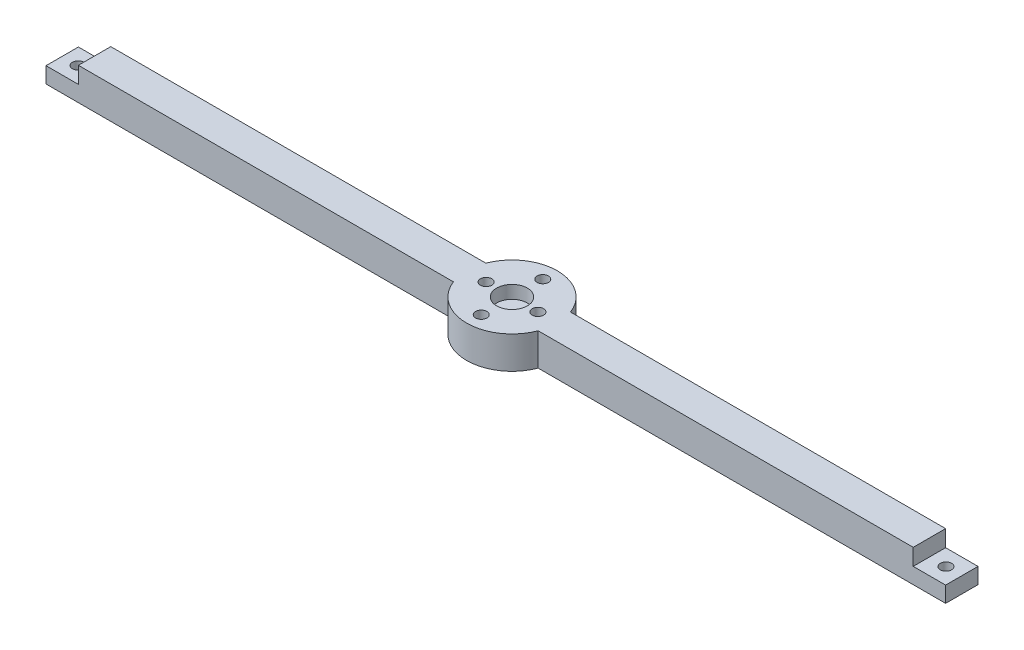
ISO-10303-21;
HEADER;
FILE_DESCRIPTION(('STEP AP214'),'2;1');
FILE_NAME('part.step','',(''),(''),'','','');
FILE_SCHEMA(('AUTOMOTIVE_DESIGN { 1 0 10303 214 1 1 1 1 }'));
ENDSEC;
DATA;
#1=APPLICATION_CONTEXT('core data for automotive mechanical design processes');
#2=APPLICATION_PROTOCOL_DEFINITION('international standard','automotive_design',2000,#1);
#3=PRODUCT_CONTEXT('',#1,'mechanical');
#4=PRODUCT('Part','Part','',(#3));
#5=PRODUCT_RELATED_PRODUCT_CATEGORY('part','',(#4));
#6=PRODUCT_DEFINITION_FORMATION('','',#4);
#7=PRODUCT_DEFINITION_CONTEXT('part definition',#1,'design');
#8=PRODUCT_DEFINITION('design','',#6,#7);
#9=PRODUCT_DEFINITION_SHAPE('','',#8);
#10=(LENGTH_UNIT() NAMED_UNIT(*) SI_UNIT(.MILLI.,.METRE.));
#11=(NAMED_UNIT(*) PLANE_ANGLE_UNIT() SI_UNIT($,.RADIAN.));
#12=(NAMED_UNIT(*) SI_UNIT($,.STERADIAN.) SOLID_ANGLE_UNIT());
#13=UNCERTAINTY_MEASURE_WITH_UNIT(LENGTH_MEASURE(1.E-05),#10,'distance_accuracy_value','');
#14=(GEOMETRIC_REPRESENTATION_CONTEXT(3) GLOBAL_UNCERTAINTY_ASSIGNED_CONTEXT((#13)) GLOBAL_UNIT_ASSIGNED_CONTEXT((#10,
#11,#12)) REPRESENTATION_CONTEXT('',''));
#15=CARTESIAN_POINT('',(0.,0.,0.));
#16=DIRECTION('',(0.,0.,1.));
#17=DIRECTION('',(1.,0.,0.));
#18=AXIS2_PLACEMENT_3D('',#15,#16,#17);
#19=CARTESIAN_POINT('',(0.,10.,0.));
#20=DIRECTION('',(0.,-1.,0.));
#21=DIRECTION('',(0.,0.,-1.));
#22=AXIS2_PLACEMENT_3D('',#19,#20,#21);
#23=CYLINDRICAL_SURFACE('',#22,14.);
#24=CARTESIAN_POINT('',(0.,0.,0.));
#25=DIRECTION('',(0.,1.,0.));
#26=DIRECTION('',(0.,0.,1.));
#27=AXIS2_PLACEMENT_3D('',#24,#25,#26);
#28=CIRCLE('',#27,14.);
#29=CARTESIAN_POINT('',(13.076696830622,0.,-5.));
#30=VERTEX_POINT('',#29);
#31=CARTESIAN_POINT('',(-13.076696830622,0.,-5.));
#32=VERTEX_POINT('',#31);
#33=EDGE_CURVE('E230',#30,#32,#28,.T.);
#34=ORIENTED_EDGE('',*,*,#33,.T.);
#35=DIRECTION('',(0.,1.,0.));
#36=VECTOR('',#35,1.);
#37=CARTESIAN_POINT('',(-13.076696830622,-136.29066125188,-5.));
#38=LINE('',#37,#36);
#39=CARTESIAN_POINT('',(-13.076696830622,10.,-5.));
#40=VERTEX_POINT('',#39);
#41=EDGE_CURVE('E157',#32,#40,#38,.T.);
#42=ORIENTED_EDGE('',*,*,#41,.T.);
#43=CARTESIAN_POINT('',(0.,10.,0.));
#44=DIRECTION('',(0.,1.,0.));
#45=DIRECTION('',(0.,0.,1.));
#46=AXIS2_PLACEMENT_3D('',#43,#44,#45);
#47=CIRCLE('',#46,14.);
#48=CARTESIAN_POINT('',(13.076696830622,10.,-5.));
#49=VERTEX_POINT('',#48);
#50=EDGE_CURVE('E150',#49,#40,#47,.T.);
#51=ORIENTED_EDGE('',*,*,#50,.F.);
#52=DIRECTION('',(0.,1.,0.));
#53=VECTOR('',#52,1.);
#54=CARTESIAN_POINT('',(13.076696830622,-136.29066125188,-5.));
#55=LINE('',#54,#53);
#56=EDGE_CURVE('E215',#30,#49,#55,.T.);
#57=ORIENTED_EDGE('',*,*,#56,.F.);
#58=EDGE_LOOP('',(#34,#42,#51,#57));
#59=FACE_BOUND('',#58,.T.);
#60=ADVANCED_FACE('F38',(#59),#23,.T.);
#61=CARTESIAN_POINT('',(-13.076696830622,10.,5.));
#62=VERTEX_POINT('',#61);
#63=CARTESIAN_POINT('',(13.076696830622,10.,5.));
#64=VERTEX_POINT('',#63);
#65=EDGE_CURVE('E229',#62,#64,#47,.T.);
#66=ORIENTED_EDGE('',*,*,#65,.F.);
#67=DIRECTION('',(0.,1.,0.));
#68=VECTOR('',#67,1.);
#69=CARTESIAN_POINT('',(-13.076696830622,-136.29066125188,5.));
#70=LINE('',#69,#68);
#71=CARTESIAN_POINT('',(-13.076696830622,0.,5.));
#72=VERTEX_POINT('',#71);
#73=EDGE_CURVE('E152',#72,#62,#70,.T.);
#74=ORIENTED_EDGE('',*,*,#73,.F.);
#75=CARTESIAN_POINT('',(13.076696830622,0.,5.));
#76=VERTEX_POINT('',#75);
#77=EDGE_CURVE('E225',#72,#76,#28,.T.);
#78=ORIENTED_EDGE('',*,*,#77,.T.);
#79=DIRECTION('',(0.,1.,0.));
#80=VECTOR('',#79,1.);
#81=CARTESIAN_POINT('',(13.076696830622,-136.29066125188,5.));
#82=LINE('',#81,#80);
#83=EDGE_CURVE('E208',#76,#64,#82,.T.);
#84=ORIENTED_EDGE('',*,*,#83,.T.);
#85=EDGE_LOOP('',(#66,#74,#78,#84));
#86=FACE_BOUND('',#85,.T.);
#87=ADVANCED_FACE('F40',(#86),#23,.T.);
#88=CARTESIAN_POINT('',(0.,10.,0.));
#89=DIRECTION('',(0.,1.,0.));
#90=DIRECTION('',(0.,0.,1.));
#91=AXIS2_PLACEMENT_3D('',#88,#89,#90);
#92=PLANE('',#91);
#93=CARTESIAN_POINT('',(0.,10.,0.));
#94=DIRECTION('',(0.,1.,0.));
#95=DIRECTION('',(0.,0.,1.));
#96=AXIS2_PLACEMENT_3D('',#93,#94,#95);
#97=CIRCLE('',#96,4.75);
#98=CARTESIAN_POINT('',(0.,10.,4.75));
#99=VERTEX_POINT('',#98);
#100=EDGE_CURVE('E315',#99,#99,#97,.T.);
#101=ORIENTED_EDGE('',*,*,#100,.F.);
#102=EDGE_LOOP('',(#101));
#103=FACE_BOUND('',#102,.T.);
#104=CARTESIAN_POINT('',(0.,10.,-9.5));
#105=DIRECTION('',(0.,1.,0.));
#106=DIRECTION('',(0.,0.,1.));
#107=AXIS2_PLACEMENT_3D('',#104,#105,#106);
#108=CIRCLE('',#107,1.75);
#109=CARTESIAN_POINT('',(0.,10.,-7.75));
#110=VERTEX_POINT('',#109);
#111=EDGE_CURVE('E308',#110,#110,#108,.T.);
#112=ORIENTED_EDGE('',*,*,#111,.F.);
#113=EDGE_LOOP('',(#112));
#114=FACE_BOUND('',#113,.T.);
#115=CARTESIAN_POINT('',(8.,10.,0.));
#116=DIRECTION('',(0.,1.,0.));
#117=DIRECTION('',(0.,0.,1.));
#118=AXIS2_PLACEMENT_3D('',#115,#116,#117);
#119=CIRCLE('',#118,1.75);
#120=CARTESIAN_POINT('',(8.,10.,1.75));
#121=VERTEX_POINT('',#120);
#122=EDGE_CURVE('E300',#121,#121,#119,.T.);
#123=ORIENTED_EDGE('',*,*,#122,.F.);
#124=EDGE_LOOP('',(#123));
#125=FACE_BOUND('',#124,.T.);
#126=CARTESIAN_POINT('',(-8.,10.,0.));
#127=DIRECTION('',(0.,1.,0.));
#128=DIRECTION('',(0.,0.,1.));
#129=AXIS2_PLACEMENT_3D('',#126,#127,#128);
#130=CIRCLE('',#129,1.75);
#131=CARTESIAN_POINT('',(-8.,10.,1.75));
#132=VERTEX_POINT('',#131);
#133=EDGE_CURVE('E292',#132,#132,#130,.T.);
#134=ORIENTED_EDGE('',*,*,#133,.F.);
#135=EDGE_LOOP('',(#134));
#136=FACE_BOUND('',#135,.T.);
#137=CARTESIAN_POINT('',(0.,10.,9.5));
#138=DIRECTION('',(0.,1.,0.));
#139=DIRECTION('',(0.,0.,1.));
#140=AXIS2_PLACEMENT_3D('',#137,#138,#139);
#141=CIRCLE('',#140,1.75);
#142=CARTESIAN_POINT('',(0.,10.,11.25));
#143=VERTEX_POINT('',#142);
#144=EDGE_CURVE('E283',#143,#143,#141,.T.);
#145=ORIENTED_EDGE('',*,*,#144,.F.);
#146=EDGE_LOOP('',(#145));
#147=FACE_BOUND('',#146,.T.);
#148=DIRECTION('',(0.,0.,-1.));
#149=VECTOR('',#148,1.);
#150=CARTESIAN_POINT('',(-128.9,10.,14.));
#151=LINE('',#150,#149);
#152=CARTESIAN_POINT('',(-128.9,10.,5.));
#153=VERTEX_POINT('',#152);
#154=CARTESIAN_POINT('',(-128.9,10.,-5.));
#155=VERTEX_POINT('',#154);
#156=EDGE_CURVE('E125',#153,#155,#151,.T.);
#157=ORIENTED_EDGE('',*,*,#156,.F.);
#158=DIRECTION('',(1.,0.,0.));
#159=VECTOR('',#158,1.);
#160=CARTESIAN_POINT('',(-13.076696830622,10.,5.));
#161=LINE('',#160,#159);
#162=EDGE_CURVE('E62',#153,#62,#161,.T.);
#163=ORIENTED_EDGE('',*,*,#162,.T.);
#164=ORIENTED_EDGE('',*,*,#65,.T.);
#165=DIRECTION('',(1.,0.,0.));
#166=VECTOR('',#165,1.);
#167=CARTESIAN_POINT('',(13.076696830622,10.,5.));
#168=LINE('',#167,#166);
#169=CARTESIAN_POINT('',(128.9,10.,5.));
#170=VERTEX_POINT('',#169);
#171=EDGE_CURVE('E211',#64,#170,#168,.T.);
#172=ORIENTED_EDGE('',*,*,#171,.T.);
#173=DIRECTION('',(0.,0.,1.));
#174=VECTOR('',#173,1.);
#175=CARTESIAN_POINT('',(128.9,10.,-14.));
#176=LINE('',#175,#174);
#177=CARTESIAN_POINT('',(128.9,10.,-5.));
#178=VERTEX_POINT('',#177);
#179=EDGE_CURVE('E189',#178,#170,#176,.T.);
#180=ORIENTED_EDGE('',*,*,#179,.F.);
#181=DIRECTION('',(-1.,0.,0.));
#182=VECTOR('',#181,1.);
#183=CARTESIAN_POINT('',(13.076696830622,10.,-5.));
#184=LINE('',#183,#182);
#185=EDGE_CURVE('E194',#178,#49,#184,.T.);
#186=ORIENTED_EDGE('',*,*,#185,.T.);
#187=ORIENTED_EDGE('',*,*,#50,.T.);
#188=DIRECTION('',(-1.,0.,0.));
#189=VECTOR('',#188,1.);
#190=CARTESIAN_POINT('',(-13.076696830622,10.,-5.));
#191=LINE('',#190,#189);
#192=EDGE_CURVE('E141',#40,#155,#191,.T.);
#193=ORIENTED_EDGE('',*,*,#192,.T.);
#194=EDGE_LOOP('',(#157,#163,#164,#172,#180,#186,#187,#193));
#195=FACE_BOUND('',#194,.T.);
#196=ADVANCED_FACE('F148',(#103,#114,#125,#136,#147,#195),#92,.T.);
#197=CARTESIAN_POINT('',(0.,0.,0.));
#198=DIRECTION('',(0.,1.,0.));
#199=DIRECTION('',(0.,0.,1.));
#200=AXIS2_PLACEMENT_3D('',#197,#198,#199);
#201=PLANE('',#200);
#202=CARTESIAN_POINT('',(0.,0.,-9.5));
#203=DIRECTION('',(0.,1.,0.));
#204=DIRECTION('',(0.,0.,1.));
#205=AXIS2_PLACEMENT_3D('',#202,#203,#204);
#206=CIRCLE('',#205,1.75);
#207=CARTESIAN_POINT('',(0.,0.,-7.75));
#208=VERTEX_POINT('',#207);
#209=EDGE_CURVE('E282',#208,#208,#206,.T.);
#210=ORIENTED_EDGE('',*,*,#209,.T.);
#211=EDGE_LOOP('',(#210));
#212=FACE_BOUND('',#211,.T.);
#213=CARTESIAN_POINT('',(8.,0.,0.));
#214=DIRECTION('',(0.,1.,0.));
#215=DIRECTION('',(0.,0.,1.));
#216=AXIS2_PLACEMENT_3D('',#213,#214,#215);
#217=CIRCLE('',#216,1.75);
#218=CARTESIAN_POINT('',(8.,0.,1.75));
#219=VERTEX_POINT('',#218);
#220=EDGE_CURVE('E304',#219,#219,#217,.T.);
#221=ORIENTED_EDGE('',*,*,#220,.T.);
#222=EDGE_LOOP('',(#221));
#223=FACE_BOUND('',#222,.T.);
#224=CARTESIAN_POINT('',(-8.,0.,0.));
#225=DIRECTION('',(0.,1.,0.));
#226=DIRECTION('',(0.,0.,1.));
#227=AXIS2_PLACEMENT_3D('',#224,#225,#226);
#228=CIRCLE('',#227,1.75);
#229=CARTESIAN_POINT('',(-8.,0.,1.75));
#230=VERTEX_POINT('',#229);
#231=EDGE_CURVE('E296',#230,#230,#228,.T.);
#232=ORIENTED_EDGE('',*,*,#231,.T.);
#233=EDGE_LOOP('',(#232));
#234=FACE_BOUND('',#233,.T.);
#235=CARTESIAN_POINT('',(0.,0.,9.5));
#236=DIRECTION('',(0.,1.,0.));
#237=DIRECTION('',(0.,0.,1.));
#238=AXIS2_PLACEMENT_3D('',#235,#236,#237);
#239=CIRCLE('',#238,1.75);
#240=CARTESIAN_POINT('',(0.,0.,11.25));
#241=VERTEX_POINT('',#240);
#242=EDGE_CURVE('E287',#241,#241,#239,.T.);
#243=ORIENTED_EDGE('',*,*,#242,.T.);
#244=EDGE_LOOP('',(#243));
#245=FACE_BOUND('',#244,.T.);
#246=CARTESIAN_POINT('',(-134.,0.,0.));
#247=DIRECTION('',(0.,1.,0.));
#248=DIRECTION('',(0.,0.,1.));
#249=AXIS2_PLACEMENT_3D('',#246,#247,#248);
#250=CIRCLE('',#249,1.75000000000001);
#251=CARTESIAN_POINT('',(-134.,0.,1.75000000000001));
#252=VERTEX_POINT('',#251);
#253=EDGE_CURVE('E145',#252,#252,#250,.T.);
#254=ORIENTED_EDGE('',*,*,#253,.T.);
#255=EDGE_LOOP('',(#254));
#256=FACE_BOUND('',#255,.T.);
#257=CARTESIAN_POINT('',(134.,0.,0.));
#258=DIRECTION('',(0.,1.,0.));
#259=DIRECTION('',(0.,0.,1.));
#260=AXIS2_PLACEMENT_3D('',#257,#258,#259);
#261=CIRCLE('',#260,1.75000000000001);
#262=CARTESIAN_POINT('',(134.,0.,1.75000000000001));
#263=VERTEX_POINT('',#262);
#264=EDGE_CURVE('E174',#263,#263,#261,.T.);
#265=ORIENTED_EDGE('',*,*,#264,.T.);
#266=EDGE_LOOP('',(#265));
#267=FACE_BOUND('',#266,.T.);
#268=DIRECTION('',(-1.,0.,0.));
#269=VECTOR('',#268,1.);
#270=CARTESIAN_POINT('',(-13.076696830622,0.,5.));
#271=LINE('',#270,#269);
#272=CARTESIAN_POINT('',(-138.9,0.,5.));
#273=VERTEX_POINT('',#272);
#274=EDGE_CURVE('E166',#72,#273,#271,.T.);
#275=ORIENTED_EDGE('',*,*,#274,.T.);
#276=DIRECTION('',(0.,0.,-1.));
#277=VECTOR('',#276,1.);
#278=CARTESIAN_POINT('',(-138.9,0.,14.));
#279=LINE('',#278,#277);
#280=CARTESIAN_POINT('',(-138.9,0.,-5.));
#281=VERTEX_POINT('',#280);
#282=EDGE_CURVE('E159',#273,#281,#279,.T.);
#283=ORIENTED_EDGE('',*,*,#282,.T.);
#284=DIRECTION('',(1.,0.,0.));
#285=VECTOR('',#284,1.);
#286=CARTESIAN_POINT('',(-13.076696830622,0.,-5.));
#287=LINE('',#286,#285);
#288=EDGE_CURVE('E164',#281,#32,#287,.T.);
#289=ORIENTED_EDGE('',*,*,#288,.T.);
#290=ORIENTED_EDGE('',*,*,#33,.F.);
#291=DIRECTION('',(1.,0.,0.));
#292=VECTOR('',#291,1.);
#293=CARTESIAN_POINT('',(13.076696830622,0.,-5.));
#294=LINE('',#293,#292);
#295=CARTESIAN_POINT('',(138.9,0.,-5.));
#296=VERTEX_POINT('',#295);
#297=EDGE_CURVE('E207',#30,#296,#294,.T.);
#298=ORIENTED_EDGE('',*,*,#297,.T.);
#299=DIRECTION('',(0.,0.,1.));
#300=VECTOR('',#299,1.);
#301=CARTESIAN_POINT('',(138.9,0.,-14.));
#302=LINE('',#301,#300);
#303=CARTESIAN_POINT('',(138.9,0.,5.));
#304=VERTEX_POINT('',#303);
#305=EDGE_CURVE('E190',#296,#304,#302,.T.);
#306=ORIENTED_EDGE('',*,*,#305,.T.);
#307=DIRECTION('',(-1.,0.,0.));
#308=VECTOR('',#307,1.);
#309=CARTESIAN_POINT('',(13.076696830622,0.,5.));
#310=LINE('',#309,#308);
#311=EDGE_CURVE('E203',#304,#76,#310,.T.);
#312=ORIENTED_EDGE('',*,*,#311,.T.);
#313=ORIENTED_EDGE('',*,*,#77,.F.);
#314=EDGE_LOOP('',(#275,#283,#289,#290,#298,#306,#312,#313));
#315=FACE_BOUND('',#314,.T.);
#316=ADVANCED_FACE('F334',(#212,#223,#234,#245,#256,#267,#315),#201,.F.);
#317=CARTESIAN_POINT('',(13.076696830622,-136.29066125188,5.));
#318=DIRECTION('',(0.,0.,1.));
#319=DIRECTION('',(1.,0.,0.));
#320=AXIS2_PLACEMENT_3D('',#317,#318,#319);
#321=PLANE('',#320);
#322=DIRECTION('',(0.,-1.,0.));
#323=VECTOR('',#322,1.);
#324=CARTESIAN_POINT('',(138.9,0.,5.));
#325=LINE('',#324,#323);
#326=CARTESIAN_POINT('',(138.9,4.9,5.));
#327=VERTEX_POINT('',#326);
#328=EDGE_CURVE('E186',#327,#304,#325,.T.);
#329=ORIENTED_EDGE('',*,*,#328,.F.);
#330=DIRECTION('',(1.,0.,0.));
#331=VECTOR('',#330,1.);
#332=CARTESIAN_POINT('',(138.9,4.9,5.));
#333=LINE('',#332,#331);
#334=CARTESIAN_POINT('',(128.9,4.9,5.));
#335=VERTEX_POINT('',#334);
#336=EDGE_CURVE('E182',#335,#327,#333,.T.);
#337=ORIENTED_EDGE('',*,*,#336,.F.);
#338=DIRECTION('',(0.,-1.,0.));
#339=VECTOR('',#338,1.);
#340=CARTESIAN_POINT('',(128.9,4.9,5.));
#341=LINE('',#340,#339);
#342=EDGE_CURVE('E178',#170,#335,#341,.T.);
#343=ORIENTED_EDGE('',*,*,#342,.F.);
#344=ORIENTED_EDGE('',*,*,#171,.F.);
#345=ORIENTED_EDGE('',*,*,#83,.F.);
#346=ORIENTED_EDGE('',*,*,#311,.F.);
#347=EDGE_LOOP('',(#329,#337,#343,#344,#345,#346));
#348=FACE_BOUND('',#347,.T.);
#349=ADVANCED_FACE('F372',(#348),#321,.T.);
#350=CARTESIAN_POINT('',(13.076696830622,-136.29066125188,-5.));
#351=DIRECTION('',(0.,0.,-1.));
#352=DIRECTION('',(-1.,0.,0.));
#353=AXIS2_PLACEMENT_3D('',#350,#351,#352);
#354=PLANE('',#353);
#355=DIRECTION('',(0.,1.,0.));
#356=VECTOR('',#355,1.);
#357=CARTESIAN_POINT('',(138.9,-136.29066125188,-5.));
#358=LINE('',#357,#356);
#359=CARTESIAN_POINT('',(138.9,4.9,-5.));
#360=VERTEX_POINT('',#359);
#361=EDGE_CURVE('E240',#296,#360,#358,.T.);
#362=ORIENTED_EDGE('',*,*,#361,.F.);
#363=ORIENTED_EDGE('',*,*,#297,.F.);
#364=ORIENTED_EDGE('',*,*,#56,.T.);
#365=ORIENTED_EDGE('',*,*,#185,.F.);
#366=DIRECTION('',(0.,1.,0.));
#367=VECTOR('',#366,1.);
#368=CARTESIAN_POINT('',(128.9,-136.29066125188,-5.));
#369=LINE('',#368,#367);
#370=CARTESIAN_POINT('',(128.9,4.89999999999999,-5.));
#371=VERTEX_POINT('',#370);
#372=EDGE_CURVE('E228',#371,#178,#369,.T.);
#373=ORIENTED_EDGE('',*,*,#372,.F.);
#374=DIRECTION('',(-1.,0.,0.));
#375=VECTOR('',#374,1.);
#376=CARTESIAN_POINT('',(13.076696830622,4.89999999999999,-5.));
#377=LINE('',#376,#375);
#378=EDGE_CURVE('E236',#360,#371,#377,.T.);
#379=ORIENTED_EDGE('',*,*,#378,.F.);
#380=EDGE_LOOP('',(#362,#363,#364,#365,#373,#379));
#381=FACE_BOUND('',#380,.T.);
#382=ADVANCED_FACE('F381',(#381),#354,.T.);
#383=CARTESIAN_POINT('',(138.9,0.,-14.));
#384=DIRECTION('',(-1.,0.,0.));
#385=DIRECTION('',(0.,0.,1.));
#386=AXIS2_PLACEMENT_3D('',#383,#384,#385);
#387=PLANE('',#386);
#388=ORIENTED_EDGE('',*,*,#361,.T.);
#389=DIRECTION('',(0.,0.,1.));
#390=VECTOR('',#389,1.);
#391=CARTESIAN_POINT('',(138.9,4.9,-14.));
#392=LINE('',#391,#390);
#393=EDGE_CURVE('E195',#360,#327,#392,.T.);
#394=ORIENTED_EDGE('',*,*,#393,.T.);
#395=ORIENTED_EDGE('',*,*,#328,.T.);
#396=ORIENTED_EDGE('',*,*,#305,.F.);
#397=EDGE_LOOP('',(#388,#394,#395,#396));
#398=FACE_BOUND('',#397,.T.);
#399=ADVANCED_FACE('F385',(#398),#387,.F.);
#400=CARTESIAN_POINT('',(138.9,4.9,-14.));
#401=DIRECTION('',(0.,-1.,0.));
#402=DIRECTION('',(0.,0.,-1.));
#403=AXIS2_PLACEMENT_3D('',#400,#401,#402);
#404=PLANE('',#403);
#405=CARTESIAN_POINT('',(134.,4.9,0.));
#406=DIRECTION('',(0.,1.,0.));
#407=DIRECTION('',(0.,0.,1.));
#408=AXIS2_PLACEMENT_3D('',#405,#406,#407);
#409=CIRCLE('',#408,1.75000000000001);
#410=CARTESIAN_POINT('',(134.,4.9,1.75000000000001));
#411=VERTEX_POINT('',#410);
#412=EDGE_CURVE('E170',#411,#411,#409,.T.);
#413=ORIENTED_EDGE('',*,*,#412,.F.);
#414=EDGE_LOOP('',(#413));
#415=FACE_BOUND('',#414,.T.);
#416=ORIENTED_EDGE('',*,*,#378,.T.);
#417=DIRECTION('',(0.,0.,1.));
#418=VECTOR('',#417,1.);
#419=CARTESIAN_POINT('',(128.9,4.9,-14.));
#420=LINE('',#419,#418);
#421=EDGE_CURVE('E198',#371,#335,#420,.T.);
#422=ORIENTED_EDGE('',*,*,#421,.T.);
#423=ORIENTED_EDGE('',*,*,#336,.T.);
#424=ORIENTED_EDGE('',*,*,#393,.F.);
#425=EDGE_LOOP('',(#416,#422,#423,#424));
#426=FACE_BOUND('',#425,.T.);
#427=ADVANCED_FACE('F387',(#415,#426),#404,.F.);
#428=CARTESIAN_POINT('',(128.9,4.9,-14.));
#429=DIRECTION('',(-1.,0.,0.));
#430=DIRECTION('',(0.,0.,1.));
#431=AXIS2_PLACEMENT_3D('',#428,#429,#430);
#432=PLANE('',#431);
#433=ORIENTED_EDGE('',*,*,#372,.T.);
#434=ORIENTED_EDGE('',*,*,#179,.T.);
#435=ORIENTED_EDGE('',*,*,#342,.T.);
#436=ORIENTED_EDGE('',*,*,#421,.F.);
#437=EDGE_LOOP('',(#433,#434,#435,#436));
#438=FACE_BOUND('',#437,.T.);
#439=ADVANCED_FACE('F388',(#438),#432,.F.);
#440=CARTESIAN_POINT('',(134.,-5.1,0.));
#441=DIRECTION('',(0.,1.,0.));
#442=DIRECTION('',(0.,0.,1.));
#443=AXIS2_PLACEMENT_3D('',#440,#441,#442);
#444=CYLINDRICAL_SURFACE('',#443,1.75000000000001);
#445=ORIENTED_EDGE('',*,*,#412,.T.);
#446=EDGE_LOOP('',(#445));
#447=FACE_BOUND('',#446,.T.);
#448=ORIENTED_EDGE('',*,*,#264,.F.);
#449=EDGE_LOOP('',(#448));
#450=FACE_BOUND('',#449,.T.);
#451=ADVANCED_FACE('F390',(#447,#450),#444,.F.);
#452=CARTESIAN_POINT('',(-13.076696830622,-136.29066125188,-5.));
#453=DIRECTION('',(0.,0.,-1.));
#454=DIRECTION('',(-1.,0.,0.));
#455=AXIS2_PLACEMENT_3D('',#452,#453,#454);
#456=PLANE('',#455);
#457=DIRECTION('',(0.,-1.,0.));
#458=VECTOR('',#457,1.);
#459=CARTESIAN_POINT('',(-138.9,0.,-5.));
#460=LINE('',#459,#458);
#461=CARTESIAN_POINT('',(-138.9,4.9,-5.));
#462=VERTEX_POINT('',#461);
#463=EDGE_CURVE('E134',#462,#281,#460,.T.);
#464=ORIENTED_EDGE('',*,*,#463,.F.);
#465=DIRECTION('',(-1.,0.,0.));
#466=VECTOR('',#465,1.);
#467=CARTESIAN_POINT('',(-138.9,4.9,-5.));
#468=LINE('',#467,#466);
#469=CARTESIAN_POINT('',(-128.9,4.9,-5.));
#470=VERTEX_POINT('',#469);
#471=EDGE_CURVE('E143',#470,#462,#468,.T.);
#472=ORIENTED_EDGE('',*,*,#471,.F.);
#473=DIRECTION('',(0.,-1.,0.));
#474=VECTOR('',#473,1.);
#475=CARTESIAN_POINT('',(-128.9,4.9,-5.));
#476=LINE('',#475,#474);
#477=EDGE_CURVE('E128',#155,#470,#476,.T.);
#478=ORIENTED_EDGE('',*,*,#477,.F.);
#479=ORIENTED_EDGE('',*,*,#192,.F.);
#480=ORIENTED_EDGE('',*,*,#41,.F.);
#481=ORIENTED_EDGE('',*,*,#288,.F.);
#482=EDGE_LOOP('',(#464,#472,#478,#479,#480,#481));
#483=FACE_BOUND('',#482,.T.);
#484=ADVANCED_FACE('F139',(#483),#456,.T.);
#485=CARTESIAN_POINT('',(-13.076696830622,-136.29066125188,5.));
#486=DIRECTION('',(0.,0.,1.));
#487=DIRECTION('',(1.,0.,0.));
#488=AXIS2_PLACEMENT_3D('',#485,#486,#487);
#489=PLANE('',#488);
#490=DIRECTION('',(0.,1.,0.));
#491=VECTOR('',#490,1.);
#492=CARTESIAN_POINT('',(-138.9,-136.29066125188,5.));
#493=LINE('',#492,#491);
#494=CARTESIAN_POINT('',(-138.9,4.9,5.));
#495=VERTEX_POINT('',#494);
#496=EDGE_CURVE('E11',#273,#495,#493,.T.);
#497=ORIENTED_EDGE('',*,*,#496,.F.);
#498=ORIENTED_EDGE('',*,*,#274,.F.);
#499=ORIENTED_EDGE('',*,*,#73,.T.);
#500=ORIENTED_EDGE('',*,*,#162,.F.);
#501=DIRECTION('',(0.,1.,0.));
#502=VECTOR('',#501,1.);
#503=CARTESIAN_POINT('',(-128.9,-136.29066125188,5.));
#504=LINE('',#503,#502);
#505=CARTESIAN_POINT('',(-128.9,4.89999999999999,5.));
#506=VERTEX_POINT('',#505);
#507=EDGE_CURVE('E131',#506,#153,#504,.T.);
#508=ORIENTED_EDGE('',*,*,#507,.F.);
#509=DIRECTION('',(1.,0.,0.));
#510=VECTOR('',#509,1.);
#511=CARTESIAN_POINT('',(-13.076696830622,4.89999999999999,5.));
#512=LINE('',#511,#510);
#513=EDGE_CURVE('E47',#495,#506,#512,.T.);
#514=ORIENTED_EDGE('',*,*,#513,.F.);
#515=EDGE_LOOP('',(#497,#498,#499,#500,#508,#514));
#516=FACE_BOUND('',#515,.T.);
#517=ADVANCED_FACE('F252',(#516),#489,.T.);
#518=CARTESIAN_POINT('',(-138.9,0.,14.));
#519=DIRECTION('',(1.,0.,0.));
#520=DIRECTION('',(0.,0.,-1.));
#521=AXIS2_PLACEMENT_3D('',#518,#519,#520);
#522=PLANE('',#521);
#523=ORIENTED_EDGE('',*,*,#496,.T.);
#524=DIRECTION('',(0.,0.,-1.));
#525=VECTOR('',#524,1.);
#526=CARTESIAN_POINT('',(-138.9,4.9,14.));
#527=LINE('',#526,#525);
#528=EDGE_CURVE('E249',#495,#462,#527,.T.);
#529=ORIENTED_EDGE('',*,*,#528,.T.);
#530=ORIENTED_EDGE('',*,*,#463,.T.);
#531=ORIENTED_EDGE('',*,*,#282,.F.);
#532=EDGE_LOOP('',(#523,#529,#530,#531));
#533=FACE_BOUND('',#532,.T.);
#534=ADVANCED_FACE('F368',(#533),#522,.F.);
#535=CARTESIAN_POINT('',(-138.9,4.9,14.));
#536=DIRECTION('',(0.,-1.,0.));
#537=DIRECTION('',(0.,0.,-1.));
#538=AXIS2_PLACEMENT_3D('',#535,#536,#537);
#539=PLANE('',#538);
#540=CARTESIAN_POINT('',(-134.,4.9,0.));
#541=DIRECTION('',(0.,1.,0.));
#542=DIRECTION('',(0.,0.,-1.));
#543=AXIS2_PLACEMENT_3D('',#540,#541,#542);
#544=CIRCLE('',#543,1.75000000000001);
#545=CARTESIAN_POINT('',(-134.,4.9,-1.75000000000001));
#546=VERTEX_POINT('',#545);
#547=EDGE_CURVE('E278',#546,#546,#544,.T.);
#548=ORIENTED_EDGE('',*,*,#547,.F.);
#549=EDGE_LOOP('',(#548));
#550=FACE_BOUND('',#549,.T.);
#551=ORIENTED_EDGE('',*,*,#513,.T.);
#552=DIRECTION('',(0.,0.,-1.));
#553=VECTOR('',#552,1.);
#554=CARTESIAN_POINT('',(-128.9,4.9,14.));
#555=LINE('',#554,#553);
#556=EDGE_CURVE('E54',#506,#470,#555,.T.);
#557=ORIENTED_EDGE('',*,*,#556,.T.);
#558=ORIENTED_EDGE('',*,*,#471,.T.);
#559=ORIENTED_EDGE('',*,*,#528,.F.);
#560=EDGE_LOOP('',(#551,#557,#558,#559));
#561=FACE_BOUND('',#560,.T.);
#562=ADVANCED_FACE('F248',(#550,#561),#539,.F.);
#563=CARTESIAN_POINT('',(-128.9,4.9,14.));
#564=DIRECTION('',(1.,0.,0.));
#565=DIRECTION('',(0.,0.,-1.));
#566=AXIS2_PLACEMENT_3D('',#563,#564,#565);
#567=PLANE('',#566);
#568=ORIENTED_EDGE('',*,*,#507,.T.);
#569=ORIENTED_EDGE('',*,*,#156,.T.);
#570=ORIENTED_EDGE('',*,*,#477,.T.);
#571=ORIENTED_EDGE('',*,*,#556,.F.);
#572=EDGE_LOOP('',(#568,#569,#570,#571));
#573=FACE_BOUND('',#572,.T.);
#574=ADVANCED_FACE('F127',(#573),#567,.F.);
#575=CARTESIAN_POINT('',(-134.,-5.1,0.));
#576=DIRECTION('',(0.,1.,0.));
#577=DIRECTION('',(0.,0.,1.));
#578=AXIS2_PLACEMENT_3D('',#575,#576,#577);
#579=CYLINDRICAL_SURFACE('',#578,1.75000000000001);
#580=ORIENTED_EDGE('',*,*,#547,.T.);
#581=EDGE_LOOP('',(#580));
#582=FACE_BOUND('',#581,.T.);
#583=ORIENTED_EDGE('',*,*,#253,.F.);
#584=EDGE_LOOP('',(#583));
#585=FACE_BOUND('',#584,.T.);
#586=ADVANCED_FACE('F347',(#582,#585),#579,.F.);
#587=CARTESIAN_POINT('',(0.,0.,9.5));
#588=DIRECTION('',(0.,1.,0.));
#589=DIRECTION('',(0.,0.,1.));
#590=AXIS2_PLACEMENT_3D('',#587,#588,#589);
#591=CYLINDRICAL_SURFACE('',#590,1.75);
#592=ORIENTED_EDGE('',*,*,#242,.F.);
#593=EDGE_LOOP('',(#592));
#594=FACE_BOUND('',#593,.T.);
#595=ORIENTED_EDGE('',*,*,#144,.T.);
#596=EDGE_LOOP('',(#595));
#597=FACE_BOUND('',#596,.T.);
#598=ADVANCED_FACE('F344',(#594,#597),#591,.F.);
#599=CARTESIAN_POINT('',(-8.,0.,0.));
#600=DIRECTION('',(0.,1.,0.));
#601=DIRECTION('',(0.,0.,1.));
#602=AXIS2_PLACEMENT_3D('',#599,#600,#601);
#603=CYLINDRICAL_SURFACE('',#602,1.75);
#604=ORIENTED_EDGE('',*,*,#231,.F.);
#605=EDGE_LOOP('',(#604));
#606=FACE_BOUND('',#605,.T.);
#607=ORIENTED_EDGE('',*,*,#133,.T.);
#608=EDGE_LOOP('',(#607));
#609=FACE_BOUND('',#608,.T.);
#610=ADVANCED_FACE('F346',(#606,#609),#603,.F.);
#611=CARTESIAN_POINT('',(8.,0.,0.));
#612=DIRECTION('',(0.,1.,0.));
#613=DIRECTION('',(0.,0.,1.));
#614=AXIS2_PLACEMENT_3D('',#611,#612,#613);
#615=CYLINDRICAL_SURFACE('',#614,1.75);
#616=ORIENTED_EDGE('',*,*,#220,.F.);
#617=EDGE_LOOP('',(#616));
#618=FACE_BOUND('',#617,.T.);
#619=ORIENTED_EDGE('',*,*,#122,.T.);
#620=EDGE_LOOP('',(#619));
#621=FACE_BOUND('',#620,.T.);
#622=ADVANCED_FACE('F354',(#618,#621),#615,.F.);
#623=CARTESIAN_POINT('',(0.,0.,-9.5));
#624=DIRECTION('',(0.,1.,0.));
#625=DIRECTION('',(0.,0.,1.));
#626=AXIS2_PLACEMENT_3D('',#623,#624,#625);
#627=CYLINDRICAL_SURFACE('',#626,1.75);
#628=ORIENTED_EDGE('',*,*,#209,.F.);
#629=EDGE_LOOP('',(#628));
#630=FACE_BOUND('',#629,.T.);
#631=ORIENTED_EDGE('',*,*,#111,.T.);
#632=EDGE_LOOP('',(#631));
#633=FACE_BOUND('',#632,.T.);
#634=ADVANCED_FACE('F328',(#630,#633),#627,.F.);
#635=CARTESIAN_POINT('',(0.,6.,0.));
#636=DIRECTION('',(0.,1.,0.));
#637=DIRECTION('',(0.,0.,1.));
#638=AXIS2_PLACEMENT_3D('',#635,#636,#637);
#639=CYLINDRICAL_SURFACE('',#638,4.75);
#640=CARTESIAN_POINT('',(0.,6.,0.));
#641=DIRECTION('',(0.,1.,0.));
#642=DIRECTION('',(0.,0.,1.));
#643=AXIS2_PLACEMENT_3D('',#640,#641,#642);
#644=CIRCLE('',#643,4.75);
#645=CARTESIAN_POINT('',(0.,6.,4.75));
#646=VERTEX_POINT('',#645);
#647=EDGE_CURVE('E288',#646,#646,#644,.T.);
#648=ORIENTED_EDGE('',*,*,#647,.F.);
#649=EDGE_LOOP('',(#648));
#650=FACE_BOUND('',#649,.T.);
#651=ORIENTED_EDGE('',*,*,#100,.T.);
#652=EDGE_LOOP('',(#651));
#653=FACE_BOUND('',#652,.T.);
#654=ADVANCED_FACE('F325',(#650,#653),#639,.F.);
#655=CARTESIAN_POINT('',(0.,6.,0.));
#656=DIRECTION('',(0.,1.,0.));
#657=DIRECTION('',(0.,0.,1.));
#658=AXIS2_PLACEMENT_3D('',#655,#656,#657);
#659=PLANE('',#658);
#660=ORIENTED_EDGE('',*,*,#647,.T.);
#661=EDGE_LOOP('',(#660));
#662=FACE_BOUND('',#661,.T.);
#663=ADVANCED_FACE('F323',(#662),#659,.T.);
#664=CLOSED_SHELL('',(#60,#87,#196,#316,#349,#382,#399,#427,#439,#451,#484,#517,#534,#562,#574,
#586,#598,#610,#622,#634,#654,#663));
#665=MANIFOLD_SOLID_BREP('B2',#664);
#666=ADVANCED_BREP_SHAPE_REPRESENTATION('',(#18,#665),#14);
#667=SHAPE_DEFINITION_REPRESENTATION(#9,#666);
ENDSEC;
END-ISO-10303-21;
